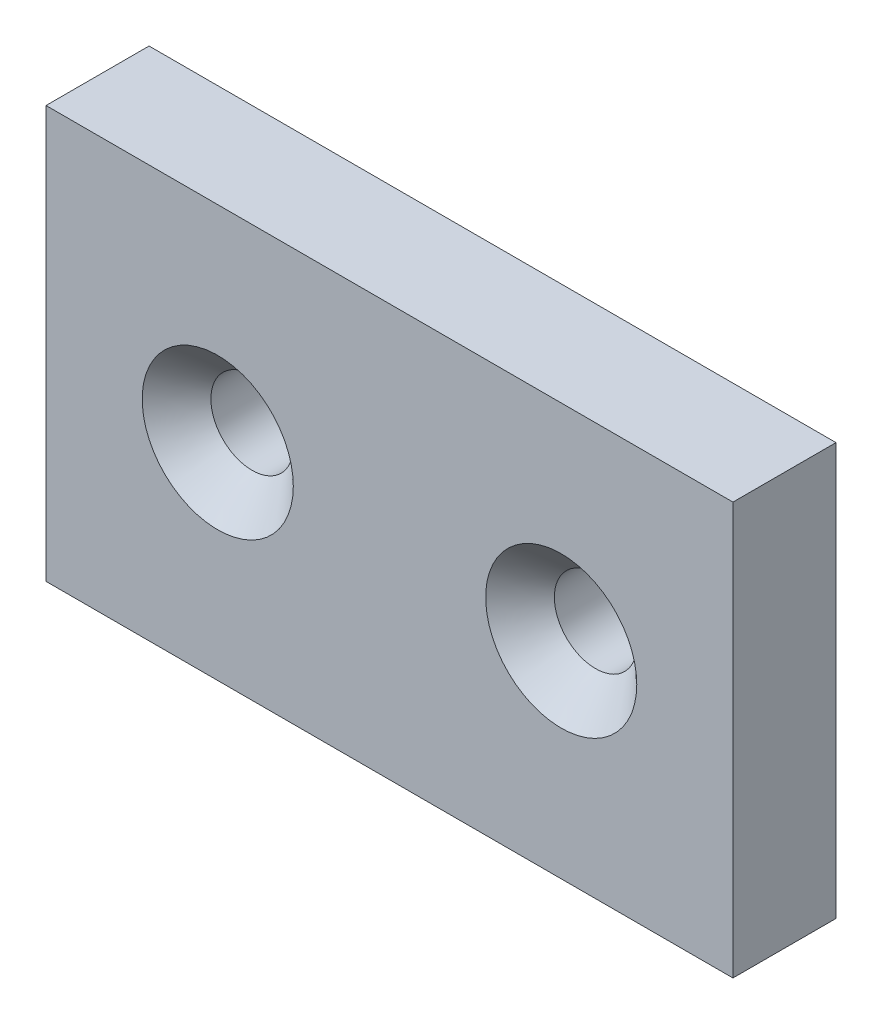
ISO-10303-21;
HEADER;
FILE_DESCRIPTION(('STEP AP214'),'2;1');
FILE_NAME('part.step','',(''),(''),'','','');
FILE_SCHEMA(('AUTOMOTIVE_DESIGN { 1 0 10303 214 1 1 1 1 }'));
ENDSEC;
DATA;
#1=APPLICATION_CONTEXT('core data for automotive mechanical design processes');
#2=APPLICATION_PROTOCOL_DEFINITION('international standard','automotive_design',2000,#1);
#3=PRODUCT_CONTEXT('',#1,'mechanical');
#4=PRODUCT('Part','Part','',(#3));
#5=PRODUCT_RELATED_PRODUCT_CATEGORY('part','',(#4));
#6=PRODUCT_DEFINITION_FORMATION('','',#4);
#7=PRODUCT_DEFINITION_CONTEXT('part definition',#1,'design');
#8=PRODUCT_DEFINITION('design','',#6,#7);
#9=PRODUCT_DEFINITION_SHAPE('','',#8);
#10=(LENGTH_UNIT() NAMED_UNIT(*) SI_UNIT(.MILLI.,.METRE.));
#11=(NAMED_UNIT(*) PLANE_ANGLE_UNIT() SI_UNIT($,.RADIAN.));
#12=(NAMED_UNIT(*) SI_UNIT($,.STERADIAN.) SOLID_ANGLE_UNIT());
#13=UNCERTAINTY_MEASURE_WITH_UNIT(LENGTH_MEASURE(1.E-05),#10,'distance_accuracy_value','');
#14=(GEOMETRIC_REPRESENTATION_CONTEXT(3) GLOBAL_UNCERTAINTY_ASSIGNED_CONTEXT((#13)) GLOBAL_UNIT_ASSIGNED_CONTEXT((#10,
#11,#12)) REPRESENTATION_CONTEXT('',''));
#15=CARTESIAN_POINT('',(0.,0.,0.));
#16=DIRECTION('',(0.,0.,1.));
#17=DIRECTION('',(1.,0.,0.));
#18=AXIS2_PLACEMENT_3D('',#15,#16,#17);
#19=CARTESIAN_POINT('',(0.,0.,3.));
#20=DIRECTION('',(1.,0.,0.));
#21=DIRECTION('',(0.,0.,-1.));
#22=AXIS2_PLACEMENT_3D('',#19,#20,#21);
#23=PLANE('',#22);
#24=DIRECTION('',(0.,-1.,0.));
#25=VECTOR('',#24,1.);
#26=CARTESIAN_POINT('',(0.,0.,3.));
#27=LINE('',#26,#25);
#28=CARTESIAN_POINT('',(-5.41233724504764E-13,15.85,3.));
#29=VERTEX_POINT('',#28);
#30=CARTESIAN_POINT('',(0.,3.84999999999997,3.));
#31=VERTEX_POINT('',#30);
#32=EDGE_CURVE('E44',#29,#31,#27,.T.);
#33=ORIENTED_EDGE('',*,*,#32,.F.);
#34=DIRECTION('',(0.,0.,-1.));
#35=VECTOR('',#34,1.);
#36=CARTESIAN_POINT('',(-5.41233724504764E-13,15.85,10.));
#37=LINE('',#36,#35);
#38=CARTESIAN_POINT('',(-5.41233724504764E-13,15.85,0.));
#39=VERTEX_POINT('',#38);
#40=EDGE_CURVE('E78',#29,#39,#37,.T.);
#41=ORIENTED_EDGE('',*,*,#40,.T.);
#42=DIRECTION('',(0.,-1.,0.));
#43=VECTOR('',#42,1.);
#44=CARTESIAN_POINT('',(0.,0.,0.));
#45=LINE('',#44,#43);
#46=CARTESIAN_POINT('',(0.,3.84999999999997,0.));
#47=VERTEX_POINT('',#46);
#48=EDGE_CURVE('E89',#39,#47,#45,.T.);
#49=ORIENTED_EDGE('',*,*,#48,.T.);
#50=DIRECTION('',(0.,0.,-1.));
#51=VECTOR('',#50,1.);
#52=CARTESIAN_POINT('',(0.,3.84999999999997,10.));
#53=LINE('',#52,#51);
#54=EDGE_CURVE('E60',#31,#47,#53,.T.);
#55=ORIENTED_EDGE('',*,*,#54,.F.);
#56=EDGE_LOOP('',(#33,#41,#49,#55));
#57=FACE_BOUND('',#56,.T.);
#58=ADVANCED_FACE('F36',(#57),#23,.F.);
#59=CARTESIAN_POINT('',(20.,0.,3.));
#60=DIRECTION('',(-1.,0.,0.));
#61=DIRECTION('',(0.,0.,1.));
#62=AXIS2_PLACEMENT_3D('',#59,#60,#61);
#63=PLANE('',#62);
#64=DIRECTION('',(0.,1.,0.));
#65=VECTOR('',#64,1.);
#66=CARTESIAN_POINT('',(20.,0.,0.));
#67=LINE('',#66,#65);
#68=CARTESIAN_POINT('',(20.0000000000003,3.84999999999997,0.));
#69=VERTEX_POINT('',#68);
#70=CARTESIAN_POINT('',(20.,15.85,0.));
#71=VERTEX_POINT('',#70);
#72=EDGE_CURVE('E39',#69,#71,#67,.T.);
#73=ORIENTED_EDGE('',*,*,#72,.T.);
#74=DIRECTION('',(0.,0.,-1.));
#75=VECTOR('',#74,1.);
#76=CARTESIAN_POINT('',(20.0000000000003,15.85,10.));
#77=LINE('',#76,#75);
#78=CARTESIAN_POINT('',(20.0000000000003,15.85,3.));
#79=VERTEX_POINT('',#78);
#80=EDGE_CURVE('E52',#79,#71,#77,.T.);
#81=ORIENTED_EDGE('',*,*,#80,.F.);
#82=DIRECTION('',(0.,1.,0.));
#83=VECTOR('',#82,1.);
#84=CARTESIAN_POINT('',(20.,0.,3.));
#85=LINE('',#84,#83);
#86=CARTESIAN_POINT('',(20.0000000000003,3.84999999999997,3.));
#87=VERTEX_POINT('',#86);
#88=EDGE_CURVE('E11',#87,#79,#85,.T.);
#89=ORIENTED_EDGE('',*,*,#88,.F.);
#90=DIRECTION('',(0.,0.,-1.));
#91=VECTOR('',#90,1.);
#92=CARTESIAN_POINT('',(20.0000000000003,3.84999999999997,10.));
#93=LINE('',#92,#91);
#94=EDGE_CURVE('E84',#87,#69,#93,.T.);
#95=ORIENTED_EDGE('',*,*,#94,.T.);
#96=EDGE_LOOP('',(#73,#81,#89,#95));
#97=FACE_BOUND('',#96,.T.);
#98=ADVANCED_FACE('F127',(#97),#63,.F.);
#99=CARTESIAN_POINT('',(0.,0.,3.));
#100=DIRECTION('',(0.,0.,-1.));
#101=DIRECTION('',(-1.,0.,0.));
#102=AXIS2_PLACEMENT_3D('',#99,#100,#101);
#103=PLANE('',#102);
#104=CARTESIAN_POINT('',(5.,9.85,3.));
#105=DIRECTION('',(0.,0.,1.));
#106=DIRECTION('',(1.,0.,0.));
#107=AXIS2_PLACEMENT_3D('',#104,#105,#106);
#108=CIRCLE('',#107,2.2);
#109=CARTESIAN_POINT('',(7.2,9.85,3.));
#110=VERTEX_POINT('',#109);
#111=EDGE_CURVE('E113',#110,#110,#108,.T.);
#112=ORIENTED_EDGE('',*,*,#111,.F.);
#113=EDGE_LOOP('',(#112));
#114=FACE_BOUND('',#113,.T.);
#115=CARTESIAN_POINT('',(15.,9.85,3.));
#116=DIRECTION('',(0.,0.,1.));
#117=DIRECTION('',(1.,0.,0.));
#118=AXIS2_PLACEMENT_3D('',#115,#116,#117);
#119=CIRCLE('',#118,2.2);
#120=CARTESIAN_POINT('',(17.2,9.85,3.));
#121=VERTEX_POINT('',#120);
#122=EDGE_CURVE('E104',#121,#121,#119,.T.);
#123=ORIENTED_EDGE('',*,*,#122,.F.);
#124=EDGE_LOOP('',(#123));
#125=FACE_BOUND('',#124,.T.);
#126=ORIENTED_EDGE('',*,*,#88,.T.);
#127=DIRECTION('',(-1.,0.,0.));
#128=VECTOR('',#127,1.);
#129=CARTESIAN_POINT('',(0.,15.85,3.));
#130=LINE('',#129,#128);
#131=EDGE_CURVE('E116',#79,#29,#130,.T.);
#132=ORIENTED_EDGE('',*,*,#131,.T.);
#133=ORIENTED_EDGE('',*,*,#32,.T.);
#134=DIRECTION('',(1.,0.,0.));
#135=VECTOR('',#134,1.);
#136=CARTESIAN_POINT('',(0.,3.84999999999997,3.));
#137=LINE('',#136,#135);
#138=EDGE_CURVE('E91',#31,#87,#137,.T.);
#139=ORIENTED_EDGE('',*,*,#138,.T.);
#140=EDGE_LOOP('',(#126,#132,#133,#139));
#141=FACE_BOUND('',#140,.T.);
#142=ADVANCED_FACE('F129',(#114,#125,#141),#103,.F.);
#143=CARTESIAN_POINT('',(0.,0.,0.));
#144=DIRECTION('',(0.,0.,-1.));
#145=DIRECTION('',(-1.,0.,0.));
#146=AXIS2_PLACEMENT_3D('',#143,#144,#145);
#147=PLANE('',#146);
#148=DIRECTION('',(-1.,0.,0.));
#149=VECTOR('',#148,1.);
#150=CARTESIAN_POINT('',(-5.41233724504764E-13,15.85,0.));
#151=LINE('',#150,#149);
#152=EDGE_CURVE('E75',#71,#39,#151,.T.);
#153=ORIENTED_EDGE('',*,*,#152,.F.);
#154=ORIENTED_EDGE('',*,*,#72,.F.);
#155=DIRECTION('',(1.,0.,0.));
#156=VECTOR('',#155,1.);
#157=CARTESIAN_POINT('',(20.0000000000003,3.84999999999997,0.));
#158=LINE('',#157,#156);
#159=EDGE_CURVE('E95',#47,#69,#158,.T.);
#160=ORIENTED_EDGE('',*,*,#159,.F.);
#161=ORIENTED_EDGE('',*,*,#48,.F.);
#162=EDGE_LOOP('',(#153,#154,#160,#161));
#163=FACE_BOUND('',#162,.T.);
#164=CARTESIAN_POINT('',(5.,9.85,0.));
#165=DIRECTION('',(0.,0.,1.));
#166=DIRECTION('',(1.,0.,0.));
#167=AXIS2_PLACEMENT_3D('',#164,#165,#166);
#168=CIRCLE('',#167,1.2);
#169=CARTESIAN_POINT('',(6.2,9.85,0.));
#170=VERTEX_POINT('',#169);
#171=EDGE_CURVE('E107',#170,#170,#168,.T.);
#172=ORIENTED_EDGE('',*,*,#171,.T.);
#173=EDGE_LOOP('',(#172));
#174=FACE_BOUND('',#173,.T.);
#175=CARTESIAN_POINT('',(15.,9.85,0.));
#176=DIRECTION('',(0.,0.,1.));
#177=DIRECTION('',(1.,0.,0.));
#178=AXIS2_PLACEMENT_3D('',#175,#176,#177);
#179=CIRCLE('',#178,1.2);
#180=CARTESIAN_POINT('',(16.2,9.85,0.));
#181=VERTEX_POINT('',#180);
#182=EDGE_CURVE('E96',#181,#181,#179,.T.);
#183=ORIENTED_EDGE('',*,*,#182,.T.);
#184=EDGE_LOOP('',(#183));
#185=FACE_BOUND('',#184,.T.);
#186=ADVANCED_FACE('F93',(#163,#174,#185),#147,.T.);
#187=CARTESIAN_POINT('',(15.,9.85,3.));
#188=DIRECTION('',(0.,0.,1.));
#189=DIRECTION('',(1.,0.,0.));
#190=AXIS2_PLACEMENT_3D('',#187,#188,#189);
#191=CYLINDRICAL_SURFACE('',#190,1.19999999999999);
#192=ORIENTED_EDGE('',*,*,#182,.F.);
#193=EDGE_LOOP('',(#192));
#194=FACE_BOUND('',#193,.T.);
#195=CARTESIAN_POINT('',(15.,9.85,2.));
#196=DIRECTION('',(0.,0.,1.));
#197=DIRECTION('',(1.,0.,0.));
#198=AXIS2_PLACEMENT_3D('',#195,#196,#197);
#199=CIRCLE('',#198,1.19999999999999);
#200=CARTESIAN_POINT('',(16.2,9.85,2.));
#201=VERTEX_POINT('',#200);
#202=EDGE_CURVE('E98',#201,#201,#199,.T.);
#203=ORIENTED_EDGE('',*,*,#202,.T.);
#204=EDGE_LOOP('',(#203));
#205=FACE_BOUND('',#204,.T.);
#206=ADVANCED_FACE('F137',(#194,#205),#191,.F.);
#207=CARTESIAN_POINT('',(15.,9.85,3.));
#208=DIRECTION('',(0.,0.,1.));
#209=DIRECTION('',(1.,0.,0.));
#210=AXIS2_PLACEMENT_3D('',#207,#208,#209);
#211=CONICAL_SURFACE('',#210,2.2,0.785398163397453);
#212=ORIENTED_EDGE('',*,*,#202,.F.);
#213=EDGE_LOOP('',(#212));
#214=FACE_BOUND('',#213,.T.);
#215=ORIENTED_EDGE('',*,*,#122,.T.);
#216=EDGE_LOOP('',(#215));
#217=FACE_BOUND('',#216,.T.);
#218=ADVANCED_FACE('F175',(#214,#217),#211,.F.);
#219=CARTESIAN_POINT('',(5.,9.85,3.));
#220=DIRECTION('',(0.,0.,1.));
#221=DIRECTION('',(1.,0.,0.));
#222=AXIS2_PLACEMENT_3D('',#219,#220,#221);
#223=CYLINDRICAL_SURFACE('',#222,1.19999999999999);
#224=ORIENTED_EDGE('',*,*,#171,.F.);
#225=EDGE_LOOP('',(#224));
#226=FACE_BOUND('',#225,.T.);
#227=CARTESIAN_POINT('',(5.,9.85,2.));
#228=DIRECTION('',(0.,0.,1.));
#229=DIRECTION('',(1.,0.,0.));
#230=AXIS2_PLACEMENT_3D('',#227,#228,#229);
#231=CIRCLE('',#230,1.19999999999999);
#232=CARTESIAN_POINT('',(6.19999999999999,9.85,2.));
#233=VERTEX_POINT('',#232);
#234=EDGE_CURVE('E110',#233,#233,#231,.T.);
#235=ORIENTED_EDGE('',*,*,#234,.T.);
#236=EDGE_LOOP('',(#235));
#237=FACE_BOUND('',#236,.T.);
#238=ADVANCED_FACE('F181',(#226,#237),#223,.F.);
#239=CARTESIAN_POINT('',(5.,9.85,3.));
#240=DIRECTION('',(0.,0.,1.));
#241=DIRECTION('',(1.,0.,0.));
#242=AXIS2_PLACEMENT_3D('',#239,#240,#241);
#243=CONICAL_SURFACE('',#242,2.2,0.785398163397453);
#244=ORIENTED_EDGE('',*,*,#234,.F.);
#245=EDGE_LOOP('',(#244));
#246=FACE_BOUND('',#245,.T.);
#247=ORIENTED_EDGE('',*,*,#111,.T.);
#248=EDGE_LOOP('',(#247));
#249=FACE_BOUND('',#248,.T.);
#250=ADVANCED_FACE('F149',(#246,#249),#243,.F.);
#251=CARTESIAN_POINT('',(20.0000000000003,3.84999999999997,10.));
#252=DIRECTION('',(0.,1.,0.));
#253=DIRECTION('',(0.,0.,1.));
#254=AXIS2_PLACEMENT_3D('',#251,#252,#253);
#255=PLANE('',#254);
#256=ORIENTED_EDGE('',*,*,#54,.T.);
#257=ORIENTED_EDGE('',*,*,#159,.T.);
#258=ORIENTED_EDGE('',*,*,#94,.F.);
#259=ORIENTED_EDGE('',*,*,#138,.F.);
#260=EDGE_LOOP('',(#256,#257,#258,#259));
#261=FACE_BOUND('',#260,.T.);
#262=ADVANCED_FACE('F124',(#261),#255,.F.);
#263=CARTESIAN_POINT('',(-5.41233724504764E-13,15.85,10.));
#264=DIRECTION('',(0.,-1.,0.));
#265=DIRECTION('',(0.,0.,-1.));
#266=AXIS2_PLACEMENT_3D('',#263,#264,#265);
#267=PLANE('',#266);
#268=ORIENTED_EDGE('',*,*,#80,.T.);
#269=ORIENTED_EDGE('',*,*,#152,.T.);
#270=ORIENTED_EDGE('',*,*,#40,.F.);
#271=ORIENTED_EDGE('',*,*,#131,.F.);
#272=EDGE_LOOP('',(#268,#269,#270,#271));
#273=FACE_BOUND('',#272,.T.);
#274=ADVANCED_FACE('F77',(#273),#267,.F.);
#275=CLOSED_SHELL('',(#58,#98,#142,#186,#206,#218,#238,#250,#262,#274));
#276=MANIFOLD_SOLID_BREP('B2',#275);
#277=ADVANCED_BREP_SHAPE_REPRESENTATION('',(#18,#276),#14);
#278=SHAPE_DEFINITION_REPRESENTATION(#9,#277);
ENDSEC;
END-ISO-10303-21;
